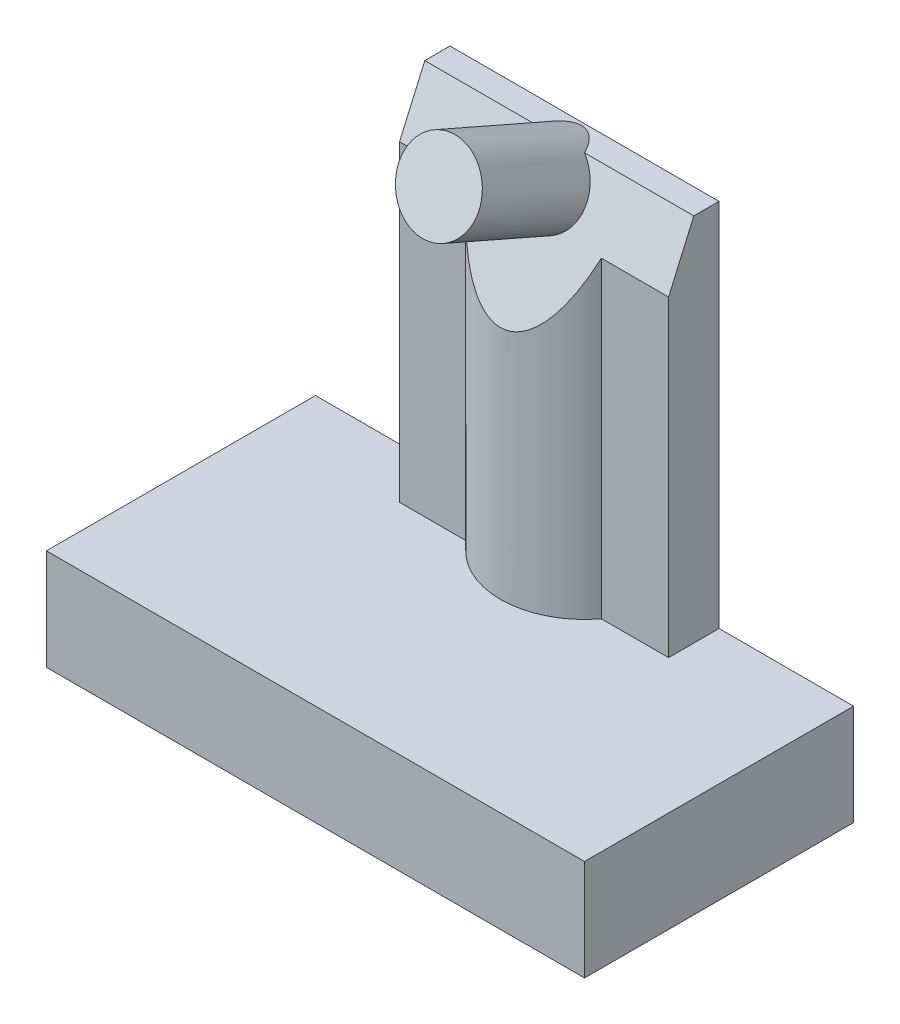
ISO-10303-21;
HEADER;
FILE_DESCRIPTION(('STEP AP214'),'2;1');
FILE_NAME('part.step','',(''),(''),'','','');
FILE_SCHEMA(('AUTOMOTIVE_DESIGN { 1 0 10303 214 1 1 1 1 }'));
ENDSEC;
DATA;
#1=APPLICATION_CONTEXT('core data for automotive mechanical design processes');
#2=APPLICATION_PROTOCOL_DEFINITION('international standard','automotive_design',2000,#1);
#3=PRODUCT_CONTEXT('',#1,'mechanical');
#4=PRODUCT('Part','Part','',(#3));
#5=PRODUCT_RELATED_PRODUCT_CATEGORY('part','',(#4));
#6=PRODUCT_DEFINITION_FORMATION('','',#4);
#7=PRODUCT_DEFINITION_CONTEXT('part definition',#1,'design');
#8=PRODUCT_DEFINITION('design','',#6,#7);
#9=PRODUCT_DEFINITION_SHAPE('','',#8);
#10=(LENGTH_UNIT() NAMED_UNIT(*) SI_UNIT(.MILLI.,.METRE.));
#11=(NAMED_UNIT(*) PLANE_ANGLE_UNIT() SI_UNIT($,.RADIAN.));
#12=(NAMED_UNIT(*) SI_UNIT($,.STERADIAN.) SOLID_ANGLE_UNIT());
#13=UNCERTAINTY_MEASURE_WITH_UNIT(LENGTH_MEASURE(1.E-05),#10,'distance_accuracy_value','');
#14=(GEOMETRIC_REPRESENTATION_CONTEXT(3) GLOBAL_UNCERTAINTY_ASSIGNED_CONTEXT((#13)) GLOBAL_UNIT_ASSIGNED_CONTEXT((#10,
#11,#12)) REPRESENTATION_CONTEXT('',''));
#15=CARTESIAN_POINT('',(0.,0.,0.));
#16=DIRECTION('',(0.,0.,1.));
#17=DIRECTION('',(1.,0.,0.));
#18=AXIS2_PLACEMENT_3D('',#15,#16,#17);
#19=CARTESIAN_POINT('',(1.,10.,-5.5));
#20=DIRECTION('',(0.,-0.400818834019707,-0.91615733490219));
#21=DIRECTION('',(0.,0.91615733490219,-0.400818834019707));
#22=AXIS2_PLACEMENT_3D('',#19,#20,#21);
#23=PLANE('',#22);
#24=CARTESIAN_POINT('',(8.,13.1428571428571,-6.875));
#25=DIRECTION('',(0.,0.400818834019707,0.91615733490219));
#26=DIRECTION('',(0.,-0.91615733490219,0.400818834019707));
#27=AXIS2_PLACEMENT_3D('',#24,#25,#26);
#28=CIRCLE('',#27,1.2);
#29=CARTESIAN_POINT('',(7.24854732521004,14.,-7.25));
#30=VERTEX_POINT('',#29);
#31=CARTESIAN_POINT('',(8.75145267478996,14.,-7.25));
#32=VERTEX_POINT('',#31);
#33=EDGE_CURVE('E46',#30,#32,#28,.T.);
#34=ORIENTED_EDGE('',*,*,#33,.F.);
#35=DIRECTION('',(-1.,0.,0.));
#36=VECTOR('',#35,1.);
#37=CARTESIAN_POINT('',(8.,14.,-7.25));
#38=LINE('',#37,#36);
#39=CARTESIAN_POINT('',(4.,14.,-7.25));
#40=VERTEX_POINT('',#39);
#41=EDGE_CURVE('E40',#30,#40,#38,.T.);
#42=ORIENTED_EDGE('',*,*,#41,.T.);
#43=DIRECTION('',(0.,0.91615733490219,-0.400818834019707));
#44=VECTOR('',#43,1.);
#45=CARTESIAN_POINT('',(4.,14.2754098360656,-7.37049180327868));
#46=LINE('',#45,#44);
#47=CARTESIAN_POINT('',(4.,12.2857142857143,-6.5));
#48=VERTEX_POINT('',#47);
#49=EDGE_CURVE('E164',#48,#40,#46,.T.);
#50=ORIENTED_EDGE('',*,*,#49,.F.);
#51=DIRECTION('',(-1.,0.,0.));
#52=VECTOR('',#51,1.);
#53=CARTESIAN_POINT('',(4.,12.2857142857143,-6.5));
#54=LINE('',#53,#52);
#55=CARTESIAN_POINT('',(6.,12.2857142857143,-6.5));
#56=VERTEX_POINT('',#55);
#57=EDGE_CURVE('E161',#56,#48,#54,.T.);
#58=ORIENTED_EDGE('',*,*,#57,.F.);
#59=CARTESIAN_POINT('',(8.,15.7142857142857,-8.));
#60=DIRECTION('',(0.,-0.400818834019707,-0.91615733490219));
#61=DIRECTION('',(0.,-0.91615733490219,0.400818834019707));
#62=AXIS2_PLACEMENT_3D('',#59,#60,#61);
#63=ELLIPSE('',#62,6.23723185591894,2.5);
#64=CARTESIAN_POINT('',(10.,12.2857142857143,-6.5));
#65=VERTEX_POINT('',#64);
#66=EDGE_CURVE('E159',#65,#56,#63,.T.);
#67=ORIENTED_EDGE('',*,*,#66,.F.);
#68=DIRECTION('',(-1.,0.,0.));
#69=VECTOR('',#68,1.);
#70=CARTESIAN_POINT('',(12.,12.2857142857143,-6.5));
#71=LINE('',#70,#69);
#72=CARTESIAN_POINT('',(12.,12.2857142857143,-6.5));
#73=VERTEX_POINT('',#72);
#74=EDGE_CURVE('E156',#73,#65,#71,.T.);
#75=ORIENTED_EDGE('',*,*,#74,.F.);
#76=DIRECTION('',(0.,0.91615733490219,-0.400818834019707));
#77=VECTOR('',#76,1.);
#78=CARTESIAN_POINT('',(12.,10.,-5.5));
#79=LINE('',#78,#77);
#80=CARTESIAN_POINT('',(12.,14.,-7.25));
#81=VERTEX_POINT('',#80);
#82=EDGE_CURVE('E52',#73,#81,#79,.T.);
#83=ORIENTED_EDGE('',*,*,#82,.T.);
#84=EDGE_CURVE('E11',#81,#32,#38,.T.);
#85=ORIENTED_EDGE('',*,*,#84,.T.);
#86=EDGE_LOOP('',(#34,#42,#50,#58,#67,#75,#83,#85));
#87=FACE_BOUND('',#86,.T.);
#88=ADVANCED_FACE('F32',(#87),#23,.F.);
#89=CARTESIAN_POINT('',(0.,3.,0.));
#90=DIRECTION('',(0.,-1.,0.));
#91=DIRECTION('',(0.,0.,-1.));
#92=AXIS2_PLACEMENT_3D('',#89,#90,#91);
#93=PLANE('',#92);
#94=DIRECTION('',(0.,0.,1.));
#95=VECTOR('',#94,1.);
#96=CARTESIAN_POINT('',(4.,3.,-8.));
#97=LINE('',#96,#95);
#98=CARTESIAN_POINT('',(4.,3.,-8.));
#99=VERTEX_POINT('',#98);
#100=CARTESIAN_POINT('',(4.,3.,-6.5));
#101=VERTEX_POINT('',#100);
#102=EDGE_CURVE('E167',#99,#101,#97,.T.);
#103=ORIENTED_EDGE('',*,*,#102,.F.);
#104=DIRECTION('',(-1.,0.,0.));
#105=VECTOR('',#104,1.);
#106=CARTESIAN_POINT('',(0.,3.,-8.));
#107=LINE('',#106,#105);
#108=CARTESIAN_POINT('',(0.,3.,-8.));
#109=VERTEX_POINT('',#108);
#110=EDGE_CURVE('E251',#99,#109,#107,.T.);
#111=ORIENTED_EDGE('',*,*,#110,.T.);
#112=DIRECTION('',(0.,0.,1.));
#113=VECTOR('',#112,1.);
#114=CARTESIAN_POINT('',(0.,3.,0.));
#115=LINE('',#114,#113);
#116=CARTESIAN_POINT('',(0.,3.,0.));
#117=VERTEX_POINT('',#116);
#118=EDGE_CURVE('E243',#109,#117,#115,.T.);
#119=ORIENTED_EDGE('',*,*,#118,.T.);
#120=DIRECTION('',(1.,0.,0.));
#121=VECTOR('',#120,1.);
#122=CARTESIAN_POINT('',(0.,3.,0.));
#123=LINE('',#122,#121);
#124=CARTESIAN_POINT('',(16.,3.,0.));
#125=VERTEX_POINT('',#124);
#126=EDGE_CURVE('E246',#117,#125,#123,.T.);
#127=ORIENTED_EDGE('',*,*,#126,.T.);
#128=DIRECTION('',(0.,0.,-1.));
#129=VECTOR('',#128,1.);
#130=CARTESIAN_POINT('',(16.,3.,0.));
#131=LINE('',#130,#129);
#132=CARTESIAN_POINT('',(16.,3.,-8.));
#133=VERTEX_POINT('',#132);
#134=EDGE_CURVE('E249',#125,#133,#131,.T.);
#135=ORIENTED_EDGE('',*,*,#134,.T.);
#136=CARTESIAN_POINT('',(12.,3.,-8.));
#137=VERTEX_POINT('',#136);
#138=EDGE_CURVE('E252',#133,#137,#107,.T.);
#139=ORIENTED_EDGE('',*,*,#138,.T.);
#140=DIRECTION('',(0.,0.,-1.));
#141=VECTOR('',#140,1.);
#142=CARTESIAN_POINT('',(12.,3.,-8.));
#143=LINE('',#142,#141);
#144=CARTESIAN_POINT('',(12.,3.,-6.5));
#145=VERTEX_POINT('',#144);
#146=EDGE_CURVE('E171',#145,#137,#143,.T.);
#147=ORIENTED_EDGE('',*,*,#146,.F.);
#148=DIRECTION('',(1.,0.,0.));
#149=VECTOR('',#148,1.);
#150=CARTESIAN_POINT('',(12.,3.,-6.5));
#151=LINE('',#150,#149);
#152=CARTESIAN_POINT('',(10.,3.,-6.5));
#153=VERTEX_POINT('',#152);
#154=EDGE_CURVE('E184',#153,#145,#151,.T.);
#155=ORIENTED_EDGE('',*,*,#154,.F.);
#156=CARTESIAN_POINT('',(8.,3.,-8.));
#157=DIRECTION('',(0.,1.,0.));
#158=DIRECTION('',(0.,0.,1.));
#159=AXIS2_PLACEMENT_3D('',#156,#157,#158);
#160=CIRCLE('',#159,2.5);
#161=CARTESIAN_POINT('',(6.,3.,-6.5));
#162=VERTEX_POINT('',#161);
#163=EDGE_CURVE('E181',#162,#153,#160,.T.);
#164=ORIENTED_EDGE('',*,*,#163,.F.);
#165=DIRECTION('',(1.,0.,0.));
#166=VECTOR('',#165,1.);
#167=CARTESIAN_POINT('',(4.,3.,-6.5));
#168=LINE('',#167,#166);
#169=EDGE_CURVE('E178',#101,#162,#168,.T.);
#170=ORIENTED_EDGE('',*,*,#169,.F.);
#171=EDGE_LOOP('',(#103,#111,#119,#127,#135,#139,#147,#155,#164,#170));
#172=FACE_BOUND('',#171,.T.);
#173=ADVANCED_FACE('F290',(#172),#93,.F.);
#174=CARTESIAN_POINT('',(0.,0.,0.));
#175=DIRECTION('',(0.,-1.,0.));
#176=DIRECTION('',(0.,0.,-1.));
#177=AXIS2_PLACEMENT_3D('',#174,#175,#176);
#178=PLANE('',#177);
#179=DIRECTION('',(0.,0.,1.));
#180=VECTOR('',#179,1.);
#181=CARTESIAN_POINT('',(0.,0.,0.));
#182=LINE('',#181,#180);
#183=CARTESIAN_POINT('',(0.,0.,-8.));
#184=VERTEX_POINT('',#183);
#185=CARTESIAN_POINT('',(0.,0.,0.));
#186=VERTEX_POINT('',#185);
#187=EDGE_CURVE('E215',#184,#186,#182,.T.);
#188=ORIENTED_EDGE('',*,*,#187,.F.);
#189=DIRECTION('',(-1.,0.,0.));
#190=VECTOR('',#189,1.);
#191=CARTESIAN_POINT('',(0.,0.,-8.));
#192=LINE('',#191,#190);
#193=CARTESIAN_POINT('',(16.,0.,-8.));
#194=VERTEX_POINT('',#193);
#195=EDGE_CURVE('E247',#194,#184,#192,.T.);
#196=ORIENTED_EDGE('',*,*,#195,.F.);
#197=DIRECTION('',(0.,0.,-1.));
#198=VECTOR('',#197,1.);
#199=CARTESIAN_POINT('',(16.,0.,0.));
#200=LINE('',#199,#198);
#201=CARTESIAN_POINT('',(16.,0.,0.));
#202=VERTEX_POINT('',#201);
#203=EDGE_CURVE('E259',#202,#194,#200,.T.);
#204=ORIENTED_EDGE('',*,*,#203,.F.);
#205=DIRECTION('',(1.,0.,0.));
#206=VECTOR('',#205,1.);
#207=CARTESIAN_POINT('',(0.,0.,0.));
#208=LINE('',#207,#206);
#209=EDGE_CURVE('E257',#186,#202,#208,.T.);
#210=ORIENTED_EDGE('',*,*,#209,.F.);
#211=EDGE_LOOP('',(#188,#196,#204,#210));
#212=FACE_BOUND('',#211,.T.);
#213=DIRECTION('',(-1.,0.,0.));
#214=VECTOR('',#213,1.);
#215=CARTESIAN_POINT('',(0.,0.,-7.));
#216=LINE('',#215,#214);
#217=CARTESIAN_POINT('',(15.,0.,-7.));
#218=VERTEX_POINT('',#217);
#219=CARTESIAN_POINT('',(1.,0.,-7.));
#220=VERTEX_POINT('',#219);
#221=EDGE_CURVE('E221',#218,#220,#216,.T.);
#222=ORIENTED_EDGE('',*,*,#221,.T.);
#223=DIRECTION('',(0.,0.,1.));
#224=VECTOR('',#223,1.);
#225=CARTESIAN_POINT('',(1.,0.,0.));
#226=LINE('',#225,#224);
#227=CARTESIAN_POINT('',(1.,0.,-1.));
#228=VERTEX_POINT('',#227);
#229=EDGE_CURVE('E209',#220,#228,#226,.T.);
#230=ORIENTED_EDGE('',*,*,#229,.T.);
#231=DIRECTION('',(1.,0.,0.));
#232=VECTOR('',#231,1.);
#233=CARTESIAN_POINT('',(0.,0.,-1.));
#234=LINE('',#233,#232);
#235=CARTESIAN_POINT('',(15.,0.,-1.));
#236=VERTEX_POINT('',#235);
#237=EDGE_CURVE('E235',#228,#236,#234,.T.);
#238=ORIENTED_EDGE('',*,*,#237,.T.);
#239=DIRECTION('',(0.,0.,-1.));
#240=VECTOR('',#239,1.);
#241=CARTESIAN_POINT('',(15.,0.,0.));
#242=LINE('',#241,#240);
#243=EDGE_CURVE('E238',#236,#218,#242,.T.);
#244=ORIENTED_EDGE('',*,*,#243,.T.);
#245=EDGE_LOOP('',(#222,#230,#238,#244));
#246=FACE_BOUND('',#245,.T.);
#247=ADVANCED_FACE('F316',(#212,#246),#178,.T.);
#248=CARTESIAN_POINT('',(0.,3.,0.));
#249=DIRECTION('',(1.,0.,0.));
#250=DIRECTION('',(0.,0.,-1.));
#251=AXIS2_PLACEMENT_3D('',#248,#249,#250);
#252=PLANE('',#251);
#253=ORIENTED_EDGE('',*,*,#187,.T.);
#254=DIRECTION('',(0.,-1.,0.));
#255=VECTOR('',#254,1.);
#256=CARTESIAN_POINT('',(0.,3.,0.));
#257=LINE('',#256,#255);
#258=EDGE_CURVE('E270',#117,#186,#257,.T.);
#259=ORIENTED_EDGE('',*,*,#258,.F.);
#260=ORIENTED_EDGE('',*,*,#118,.F.);
#261=DIRECTION('',(0.,-1.,0.));
#262=VECTOR('',#261,1.);
#263=CARTESIAN_POINT('',(0.,3.,-8.));
#264=LINE('',#263,#262);
#265=EDGE_CURVE('E254',#109,#184,#264,.T.);
#266=ORIENTED_EDGE('',*,*,#265,.T.);
#267=EDGE_LOOP('',(#253,#259,#260,#266));
#268=FACE_BOUND('',#267,.T.);
#269=ADVANCED_FACE('F34',(#268),#252,.F.);
#270=CARTESIAN_POINT('',(0.,3.,0.));
#271=DIRECTION('',(0.,0.,-1.));
#272=DIRECTION('',(-1.,0.,0.));
#273=AXIS2_PLACEMENT_3D('',#270,#271,#272);
#274=PLANE('',#273);
#275=ORIENTED_EDGE('',*,*,#209,.T.);
#276=DIRECTION('',(0.,-1.,0.));
#277=VECTOR('',#276,1.);
#278=CARTESIAN_POINT('',(16.,3.,0.));
#279=LINE('',#278,#277);
#280=EDGE_CURVE('E267',#125,#202,#279,.T.);
#281=ORIENTED_EDGE('',*,*,#280,.F.);
#282=ORIENTED_EDGE('',*,*,#126,.F.);
#283=ORIENTED_EDGE('',*,*,#258,.T.);
#284=EDGE_LOOP('',(#275,#281,#282,#283));
#285=FACE_BOUND('',#284,.T.);
#286=ADVANCED_FACE('F343',(#285),#274,.F.);
#287=CARTESIAN_POINT('',(16.,3.,0.));
#288=DIRECTION('',(-1.,0.,0.));
#289=DIRECTION('',(0.,0.,1.));
#290=AXIS2_PLACEMENT_3D('',#287,#288,#289);
#291=PLANE('',#290);
#292=ORIENTED_EDGE('',*,*,#203,.T.);
#293=DIRECTION('',(0.,-1.,0.));
#294=VECTOR('',#293,1.);
#295=CARTESIAN_POINT('',(16.,3.,-8.));
#296=LINE('',#295,#294);
#297=EDGE_CURVE('E264',#133,#194,#296,.T.);
#298=ORIENTED_EDGE('',*,*,#297,.F.);
#299=ORIENTED_EDGE('',*,*,#134,.F.);
#300=ORIENTED_EDGE('',*,*,#280,.T.);
#301=EDGE_LOOP('',(#292,#298,#299,#300));
#302=FACE_BOUND('',#301,.T.);
#303=ADVANCED_FACE('F334',(#302),#291,.F.);
#304=CARTESIAN_POINT('',(0.,3.,-8.));
#305=DIRECTION('',(0.,0.,1.));
#306=DIRECTION('',(1.,0.,0.));
#307=AXIS2_PLACEMENT_3D('',#304,#305,#306);
#308=PLANE('',#307);
#309=ORIENTED_EDGE('',*,*,#195,.T.);
#310=ORIENTED_EDGE('',*,*,#265,.F.);
#311=ORIENTED_EDGE('',*,*,#110,.F.);
#312=DIRECTION('',(0.,-1.,0.));
#313=VECTOR('',#312,1.);
#314=CARTESIAN_POINT('',(4.,14.,-8.));
#315=LINE('',#314,#313);
#316=CARTESIAN_POINT('',(4.,14.,-8.));
#317=VERTEX_POINT('',#316);
#318=EDGE_CURVE('E175',#317,#99,#315,.T.);
#319=ORIENTED_EDGE('',*,*,#318,.F.);
#320=DIRECTION('',(-1.,0.,0.));
#321=VECTOR('',#320,1.);
#322=CARTESIAN_POINT('',(4.,14.,-8.));
#323=LINE('',#322,#321);
#324=CARTESIAN_POINT('',(12.,14.,-8.));
#325=VERTEX_POINT('',#324);
#326=EDGE_CURVE('E173',#325,#317,#323,.T.);
#327=ORIENTED_EDGE('',*,*,#326,.F.);
#328=DIRECTION('',(0.,-1.,0.));
#329=VECTOR('',#328,1.);
#330=CARTESIAN_POINT('',(12.,14.,-8.));
#331=LINE('',#330,#329);
#332=EDGE_CURVE('E191',#325,#137,#331,.T.);
#333=ORIENTED_EDGE('',*,*,#332,.T.);
#334=ORIENTED_EDGE('',*,*,#138,.F.);
#335=ORIENTED_EDGE('',*,*,#297,.T.);
#336=EDGE_LOOP('',(#309,#310,#311,#319,#327,#333,#334,#335));
#337=FACE_BOUND('',#336,.T.);
#338=ADVANCED_FACE('F286',(#337),#308,.F.);
#339=CARTESIAN_POINT('',(1.,3.,0.));
#340=DIRECTION('',(1.,0.,0.));
#341=DIRECTION('',(0.,0.,-1.));
#342=AXIS2_PLACEMENT_3D('',#339,#340,#341);
#343=PLANE('',#342);
#344=ORIENTED_EDGE('',*,*,#229,.F.);
#345=DIRECTION('',(0.,-1.,0.));
#346=VECTOR('',#345,1.);
#347=CARTESIAN_POINT('',(1.,3.,-7.));
#348=LINE('',#347,#346);
#349=CARTESIAN_POINT('',(1.,2.,-7.));
#350=VERTEX_POINT('',#349);
#351=EDGE_CURVE('E222',#350,#220,#348,.T.);
#352=ORIENTED_EDGE('',*,*,#351,.F.);
#353=DIRECTION('',(0.,0.,1.));
#354=VECTOR('',#353,1.);
#355=CARTESIAN_POINT('',(1.,2.,0.));
#356=LINE('',#355,#354);
#357=CARTESIAN_POINT('',(1.,2.,-1.));
#358=VERTEX_POINT('',#357);
#359=EDGE_CURVE('E217',#350,#358,#356,.T.);
#360=ORIENTED_EDGE('',*,*,#359,.T.);
#361=DIRECTION('',(0.,-1.,0.));
#362=VECTOR('',#361,1.);
#363=CARTESIAN_POINT('',(1.,3.,-1.));
#364=LINE('',#363,#362);
#365=EDGE_CURVE('E212',#358,#228,#364,.T.);
#366=ORIENTED_EDGE('',*,*,#365,.T.);
#367=EDGE_LOOP('',(#344,#352,#360,#366));
#368=FACE_BOUND('',#367,.T.);
#369=ADVANCED_FACE('F353',(#368),#343,.T.);
#370=CARTESIAN_POINT('',(0.,3.,-1.));
#371=DIRECTION('',(0.,0.,-1.));
#372=DIRECTION('',(-1.,0.,0.));
#373=AXIS2_PLACEMENT_3D('',#370,#371,#372);
#374=PLANE('',#373);
#375=ORIENTED_EDGE('',*,*,#237,.F.);
#376=ORIENTED_EDGE('',*,*,#365,.F.);
#377=DIRECTION('',(1.,0.,0.));
#378=VECTOR('',#377,1.);
#379=CARTESIAN_POINT('',(0.,2.,-1.));
#380=LINE('',#379,#378);
#381=CARTESIAN_POINT('',(15.,2.,-1.));
#382=VERTEX_POINT('',#381);
#383=EDGE_CURVE('E220',#358,#382,#380,.T.);
#384=ORIENTED_EDGE('',*,*,#383,.T.);
#385=DIRECTION('',(0.,-1.,0.));
#386=VECTOR('',#385,1.);
#387=CARTESIAN_POINT('',(15.,3.,-1.));
#388=LINE('',#387,#386);
#389=EDGE_CURVE('E216',#382,#236,#388,.T.);
#390=ORIENTED_EDGE('',*,*,#389,.T.);
#391=EDGE_LOOP('',(#375,#376,#384,#390));
#392=FACE_BOUND('',#391,.T.);
#393=ADVANCED_FACE('F369',(#392),#374,.T.);
#394=CARTESIAN_POINT('',(15.,3.,0.));
#395=DIRECTION('',(-1.,0.,0.));
#396=DIRECTION('',(0.,0.,1.));
#397=AXIS2_PLACEMENT_3D('',#394,#395,#396);
#398=PLANE('',#397);
#399=ORIENTED_EDGE('',*,*,#243,.F.);
#400=ORIENTED_EDGE('',*,*,#389,.F.);
#401=DIRECTION('',(0.,0.,-1.));
#402=VECTOR('',#401,1.);
#403=CARTESIAN_POINT('',(15.,2.,0.));
#404=LINE('',#403,#402);
#405=CARTESIAN_POINT('',(15.,2.,-7.));
#406=VERTEX_POINT('',#405);
#407=EDGE_CURVE('E229',#382,#406,#404,.T.);
#408=ORIENTED_EDGE('',*,*,#407,.T.);
#409=DIRECTION('',(0.,-1.,0.));
#410=VECTOR('',#409,1.);
#411=CARTESIAN_POINT('',(15.,3.,-7.));
#412=LINE('',#411,#410);
#413=EDGE_CURVE('E224',#406,#218,#412,.T.);
#414=ORIENTED_EDGE('',*,*,#413,.T.);
#415=EDGE_LOOP('',(#399,#400,#408,#414));
#416=FACE_BOUND('',#415,.T.);
#417=ADVANCED_FACE('F365',(#416),#398,.T.);
#418=CARTESIAN_POINT('',(0.,3.,-7.));
#419=DIRECTION('',(0.,0.,1.));
#420=DIRECTION('',(1.,0.,0.));
#421=AXIS2_PLACEMENT_3D('',#418,#419,#420);
#422=PLANE('',#421);
#423=ORIENTED_EDGE('',*,*,#221,.F.);
#424=ORIENTED_EDGE('',*,*,#413,.F.);
#425=DIRECTION('',(-1.,0.,0.));
#426=VECTOR('',#425,1.);
#427=CARTESIAN_POINT('',(0.,2.,-7.));
#428=LINE('',#427,#426);
#429=EDGE_CURVE('E225',#406,#350,#428,.T.);
#430=ORIENTED_EDGE('',*,*,#429,.T.);
#431=ORIENTED_EDGE('',*,*,#351,.T.);
#432=EDGE_LOOP('',(#423,#424,#430,#431));
#433=FACE_BOUND('',#432,.T.);
#434=ADVANCED_FACE('F360',(#433),#422,.T.);
#435=CARTESIAN_POINT('',(0.,2.,0.));
#436=DIRECTION('',(0.,-1.,0.));
#437=DIRECTION('',(0.,0.,-1.));
#438=AXIS2_PLACEMENT_3D('',#435,#436,#437);
#439=PLANE('',#438);
#440=CARTESIAN_POINT('',(8.,2.,-4.));
#441=DIRECTION('',(0.,-1.,0.));
#442=DIRECTION('',(0.,0.,-1.));
#443=AXIS2_PLACEMENT_3D('',#440,#441,#442);
#444=CIRCLE('',#443,1.5);
#445=CARTESIAN_POINT('',(8.,2.,-5.5));
#446=VERTEX_POINT('',#445);
#447=EDGE_CURVE('E205',#446,#446,#444,.T.);
#448=ORIENTED_EDGE('',*,*,#447,.F.);
#449=EDGE_LOOP('',(#448));
#450=FACE_BOUND('',#449,.T.);
#451=ORIENTED_EDGE('',*,*,#359,.F.);
#452=ORIENTED_EDGE('',*,*,#429,.F.);
#453=ORIENTED_EDGE('',*,*,#407,.F.);
#454=ORIENTED_EDGE('',*,*,#383,.F.);
#455=EDGE_LOOP('',(#451,#452,#453,#454));
#456=FACE_BOUND('',#455,.T.);
#457=ADVANCED_FACE('F356',(#450,#456),#439,.T.);
#458=CARTESIAN_POINT('',(8.,0.,-4.));
#459=DIRECTION('',(0.,-1.,0.));
#460=DIRECTION('',(0.,0.,-1.));
#461=AXIS2_PLACEMENT_3D('',#458,#459,#460);
#462=PLANE('',#461);
#463=CARTESIAN_POINT('',(8.,0.,-4.));
#464=DIRECTION('',(0.,-1.,0.));
#465=DIRECTION('',(0.,0.,-1.));
#466=AXIS2_PLACEMENT_3D('',#463,#464,#465);
#467=CIRCLE('',#466,1.5);
#468=CARTESIAN_POINT('',(8.,0.,-5.5));
#469=VERTEX_POINT('',#468);
#470=EDGE_CURVE('E206',#469,#469,#467,.T.);
#471=ORIENTED_EDGE('',*,*,#470,.T.);
#472=EDGE_LOOP('',(#471));
#473=FACE_BOUND('',#472,.T.);
#474=CARTESIAN_POINT('',(8.,0.,-4.));
#475=DIRECTION('',(0.,-1.,0.));
#476=DIRECTION('',(0.,0.,-1.));
#477=AXIS2_PLACEMENT_3D('',#474,#475,#476);
#478=CIRCLE('',#477,0.8);
#479=CARTESIAN_POINT('',(8.,0.,-4.8));
#480=VERTEX_POINT('',#479);
#481=EDGE_CURVE('E202',#480,#480,#478,.T.);
#482=ORIENTED_EDGE('',*,*,#481,.F.);
#483=EDGE_LOOP('',(#482));
#484=FACE_BOUND('',#483,.T.);
#485=ADVANCED_FACE('F359',(#473,#484),#462,.T.);
#486=CARTESIAN_POINT('',(8.,0.,-4.));
#487=DIRECTION('',(0.,1.,0.));
#488=DIRECTION('',(0.,0.,1.));
#489=AXIS2_PLACEMENT_3D('',#486,#487,#488);
#490=CYLINDRICAL_SURFACE('',#489,1.5);
#491=ORIENTED_EDGE('',*,*,#470,.F.);
#492=EDGE_LOOP('',(#491));
#493=FACE_BOUND('',#492,.T.);
#494=ORIENTED_EDGE('',*,*,#447,.T.);
#495=EDGE_LOOP('',(#494));
#496=FACE_BOUND('',#495,.T.);
#497=ADVANCED_FACE('F377',(#493,#496),#490,.T.);
#498=CARTESIAN_POINT('',(8.,0.,-4.));
#499=DIRECTION('',(0.,1.,0.));
#500=DIRECTION('',(0.,0.,1.));
#501=AXIS2_PLACEMENT_3D('',#498,#499,#500);
#502=CYLINDRICAL_SURFACE('',#501,0.8);
#503=ORIENTED_EDGE('',*,*,#481,.T.);
#504=EDGE_LOOP('',(#503));
#505=FACE_BOUND('',#504,.T.);
#506=CARTESIAN_POINT('',(8.,2.,-4.));
#507=DIRECTION('',(0.,-1.,0.));
#508=DIRECTION('',(0.,0.,-1.));
#509=AXIS2_PLACEMENT_3D('',#506,#507,#508);
#510=CIRCLE('',#509,0.8);
#511=CARTESIAN_POINT('',(8.,2.,-4.8));
#512=VERTEX_POINT('',#511);
#513=EDGE_CURVE('E272',#512,#512,#510,.F.);
#514=ORIENTED_EDGE('',*,*,#513,.T.);
#515=EDGE_LOOP('',(#514));
#516=FACE_BOUND('',#515,.T.);
#517=ADVANCED_FACE('F380',(#505,#516),#502,.F.);
#518=ORIENTED_EDGE('',*,*,#513,.F.);
#519=EDGE_LOOP('',(#518));
#520=FACE_BOUND('',#519,.T.);
#521=ADVANCED_FACE('F362',(#520),#439,.T.);
#522=CARTESIAN_POINT('',(4.,14.,-8.));
#523=DIRECTION('',(1.,0.,0.));
#524=DIRECTION('',(0.,0.,-1.));
#525=AXIS2_PLACEMENT_3D('',#522,#523,#524);
#526=PLANE('',#525);
#527=DIRECTION('',(0.,-1.,0.));
#528=VECTOR('',#527,1.);
#529=CARTESIAN_POINT('',(4.,14.,-6.5));
#530=LINE('',#529,#528);
#531=EDGE_CURVE('E200',#48,#101,#530,.T.);
#532=ORIENTED_EDGE('',*,*,#531,.F.);
#533=ORIENTED_EDGE('',*,*,#49,.T.);
#534=DIRECTION('',(0.,0.,1.));
#535=VECTOR('',#534,1.);
#536=CARTESIAN_POINT('',(4.,14.,-8.));
#537=LINE('',#536,#535);
#538=EDGE_CURVE('E168',#317,#40,#537,.T.);
#539=ORIENTED_EDGE('',*,*,#538,.F.);
#540=ORIENTED_EDGE('',*,*,#318,.T.);
#541=ORIENTED_EDGE('',*,*,#102,.T.);
#542=EDGE_LOOP('',(#532,#533,#539,#540,#541));
#543=FACE_BOUND('',#542,.T.);
#544=ADVANCED_FACE('F280',(#543),#526,.F.);
#545=CARTESIAN_POINT('',(4.,14.,-6.5));
#546=DIRECTION('',(0.,0.,-1.));
#547=DIRECTION('',(-1.,0.,0.));
#548=AXIS2_PLACEMENT_3D('',#545,#546,#547);
#549=PLANE('',#548);
#550=DIRECTION('',(0.,-1.,0.));
#551=VECTOR('',#550,1.);
#552=CARTESIAN_POINT('',(6.,14.,-6.5));
#553=LINE('',#552,#551);
#554=EDGE_CURVE('E198',#56,#162,#553,.T.);
#555=ORIENTED_EDGE('',*,*,#554,.F.);
#556=ORIENTED_EDGE('',*,*,#57,.T.);
#557=ORIENTED_EDGE('',*,*,#531,.T.);
#558=ORIENTED_EDGE('',*,*,#169,.T.);
#559=EDGE_LOOP('',(#555,#556,#557,#558));
#560=FACE_BOUND('',#559,.T.);
#561=ADVANCED_FACE('F295',(#560),#549,.F.);
#562=CARTESIAN_POINT('',(8.,14.,-8.));
#563=DIRECTION('',(0.,-1.,0.));
#564=DIRECTION('',(0.,0.,-1.));
#565=AXIS2_PLACEMENT_3D('',#562,#563,#564);
#566=CYLINDRICAL_SURFACE('',#565,2.5);
#567=ORIENTED_EDGE('',*,*,#66,.T.);
#568=ORIENTED_EDGE('',*,*,#554,.T.);
#569=ORIENTED_EDGE('',*,*,#163,.T.);
#570=DIRECTION('',(0.,-1.,0.));
#571=VECTOR('',#570,1.);
#572=CARTESIAN_POINT('',(10.,14.,-6.5));
#573=LINE('',#572,#571);
#574=EDGE_CURVE('E196',#65,#153,#573,.T.);
#575=ORIENTED_EDGE('',*,*,#574,.F.);
#576=EDGE_LOOP('',(#567,#568,#569,#575));
#577=FACE_BOUND('',#576,.T.);
#578=ADVANCED_FACE('F301',(#577),#566,.T.);
#579=CARTESIAN_POINT('',(12.,14.,-6.5));
#580=DIRECTION('',(0.,0.,-1.));
#581=DIRECTION('',(-1.,0.,0.));
#582=AXIS2_PLACEMENT_3D('',#579,#580,#581);
#583=PLANE('',#582);
#584=DIRECTION('',(0.,-1.,0.));
#585=VECTOR('',#584,1.);
#586=CARTESIAN_POINT('',(12.,14.,-6.5));
#587=LINE('',#586,#585);
#588=EDGE_CURVE('E194',#73,#145,#587,.T.);
#589=ORIENTED_EDGE('',*,*,#588,.F.);
#590=ORIENTED_EDGE('',*,*,#74,.T.);
#591=ORIENTED_EDGE('',*,*,#574,.T.);
#592=ORIENTED_EDGE('',*,*,#154,.T.);
#593=EDGE_LOOP('',(#589,#590,#591,#592));
#594=FACE_BOUND('',#593,.T.);
#595=ADVANCED_FACE('F300',(#594),#583,.F.);
#596=CARTESIAN_POINT('',(12.,14.,-8.));
#597=DIRECTION('',(-1.,0.,0.));
#598=DIRECTION('',(0.,0.,1.));
#599=AXIS2_PLACEMENT_3D('',#596,#597,#598);
#600=PLANE('',#599);
#601=DIRECTION('',(0.,0.,-1.));
#602=VECTOR('',#601,1.);
#603=CARTESIAN_POINT('',(12.,14.,-8.));
#604=LINE('',#603,#602);
#605=EDGE_CURVE('E170',#81,#325,#604,.T.);
#606=ORIENTED_EDGE('',*,*,#605,.F.);
#607=ORIENTED_EDGE('',*,*,#82,.F.);
#608=ORIENTED_EDGE('',*,*,#588,.T.);
#609=ORIENTED_EDGE('',*,*,#146,.T.);
#610=ORIENTED_EDGE('',*,*,#332,.F.);
#611=EDGE_LOOP('',(#606,#607,#608,#609,#610));
#612=FACE_BOUND('',#611,.T.);
#613=ADVANCED_FACE('F308',(#612),#600,.F.);
#614=CARTESIAN_POINT('',(8.,14.,-8.));
#615=DIRECTION('',(0.,1.,0.));
#616=DIRECTION('',(0.,0.,1.));
#617=AXIS2_PLACEMENT_3D('',#614,#615,#616);
#618=PLANE('',#617);
#619=ORIENTED_EDGE('',*,*,#41,.F.);
#620=CARTESIAN_POINT('',(8.,13.9999999999816,-4.9158163265588));
#621=DIRECTION('',(0.,1.,0.));
#622=DIRECTION('',(0.,0.,1.));
#623=AXIS2_PLACEMENT_3D('',#620,#621,#622);
#624=ELLIPSE('',#623,2.99387129084109,1.2);
#625=EDGE_CURVE('E144',#30,#32,#624,.F.);
#626=ORIENTED_EDGE('',*,*,#625,.T.);
#627=ORIENTED_EDGE('',*,*,#84,.F.);
#628=ORIENTED_EDGE('',*,*,#605,.T.);
#629=ORIENTED_EDGE('',*,*,#326,.T.);
#630=ORIENTED_EDGE('',*,*,#538,.T.);
#631=EDGE_LOOP('',(#619,#626,#627,#628,#629,#630));
#632=FACE_BOUND('',#631,.T.);
#633=ADVANCED_FACE('F145',(#632),#618,.T.);
#634=CARTESIAN_POINT('',(8.,14.5457230619261,-3.66844932784234));
#635=DIRECTION('',(0.,-0.400818834019707,-0.91615733490219));
#636=DIRECTION('',(0.,0.91615733490219,-0.400818834019707));
#637=AXIS2_PLACEMENT_3D('',#634,#635,#636);
#638=CYLINDRICAL_SURFACE('',#637,1.2);
#639=CARTESIAN_POINT('',(8.,14.5457230619261,-3.66844932784234));
#640=DIRECTION('',(0.,0.400818834019707,0.91615733490219));
#641=DIRECTION('',(0.,-0.91615733490219,0.400818834019707));
#642=AXIS2_PLACEMENT_3D('',#639,#640,#641);
#643=CIRCLE('',#642,1.2);
#644=CARTESIAN_POINT('',(8.,13.4463342600435,-3.18746672701869));
#645=VERTEX_POINT('',#644);
#646=EDGE_CURVE('E150',#645,#645,#643,.T.);
#647=ORIENTED_EDGE('',*,*,#646,.F.);
#648=EDGE_LOOP('',(#647));
#649=FACE_BOUND('',#648,.T.);
#650=ORIENTED_EDGE('',*,*,#33,.T.);
#651=ORIENTED_EDGE('',*,*,#625,.F.);
#652=EDGE_LOOP('',(#650,#651));
#653=FACE_BOUND('',#652,.T.);
#654=ADVANCED_FACE('F149',(#649,#653),#638,.T.);
#655=CARTESIAN_POINT('',(8.,14.5457230619261,-3.66844932784234));
#656=DIRECTION('',(0.,0.400818834019707,0.91615733490219));
#657=DIRECTION('',(0.,-0.91615733490219,0.400818834019707));
#658=AXIS2_PLACEMENT_3D('',#655,#656,#657);
#659=PLANE('',#658);
#660=ORIENTED_EDGE('',*,*,#646,.T.);
#661=EDGE_LOOP('',(#660));
#662=FACE_BOUND('',#661,.T.);
#663=ADVANCED_FACE('F505',(#662),#659,.T.);
#664=CLOSED_SHELL('',(#88,#173,#247,#269,#286,#303,#338,#369,#393,#417,#434,#457,#485,#497,#517,
#521,#544,#561,#578,#595,#613,#633,#654,#663));
#665=MANIFOLD_SOLID_BREP('B2',#664);
#666=ADVANCED_BREP_SHAPE_REPRESENTATION('',(#18,#665),#14);
#667=SHAPE_DEFINITION_REPRESENTATION(#9,#666);
ENDSEC;
END-ISO-10303-21;
